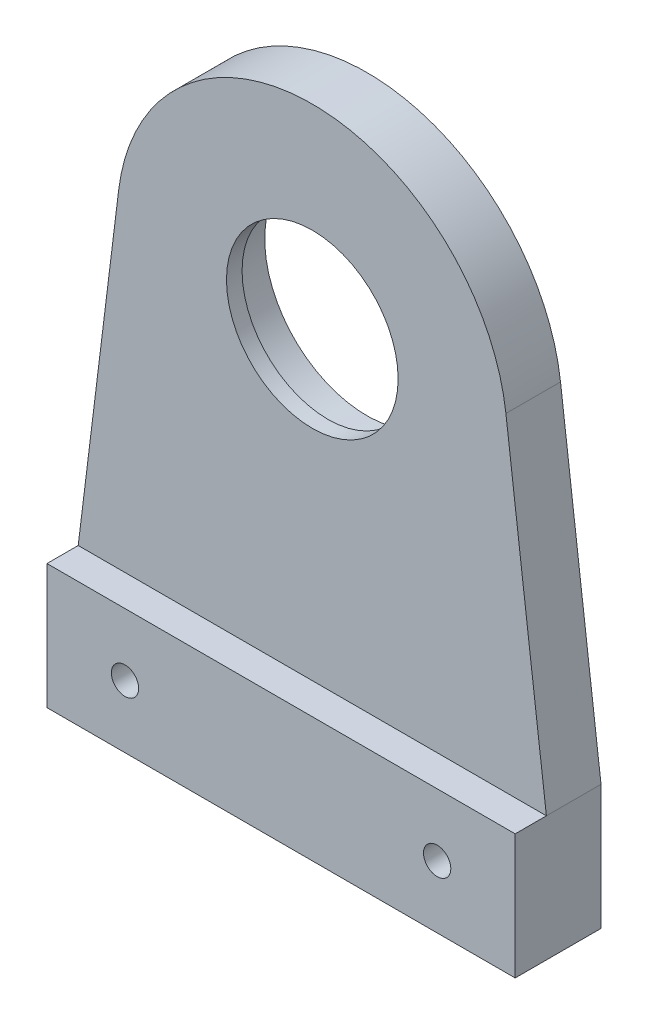
ISO-10303-21;
HEADER;
FILE_DESCRIPTION(('STEP AP214'),'2;1');
FILE_NAME('part.step','',(''),(''),'','','');
FILE_SCHEMA(('AUTOMOTIVE_DESIGN { 1 0 10303 214 1 1 1 1 }'));
ENDSEC;
DATA;
#1=APPLICATION_CONTEXT('core data for automotive mechanical design processes');
#2=APPLICATION_PROTOCOL_DEFINITION('international standard','automotive_design',2000,#1);
#3=PRODUCT_CONTEXT('',#1,'mechanical');
#4=PRODUCT('Part','Part','',(#3));
#5=PRODUCT_RELATED_PRODUCT_CATEGORY('part','',(#4));
#6=PRODUCT_DEFINITION_FORMATION('','',#4);
#7=PRODUCT_DEFINITION_CONTEXT('part definition',#1,'design');
#8=PRODUCT_DEFINITION('design','',#6,#7);
#9=PRODUCT_DEFINITION_SHAPE('','',#8);
#10=(LENGTH_UNIT() NAMED_UNIT(*) SI_UNIT(.MILLI.,.METRE.));
#11=(NAMED_UNIT(*) PLANE_ANGLE_UNIT() SI_UNIT($,.RADIAN.));
#12=(NAMED_UNIT(*) SI_UNIT($,.STERADIAN.) SOLID_ANGLE_UNIT());
#13=UNCERTAINTY_MEASURE_WITH_UNIT(LENGTH_MEASURE(1.E-05),#10,'distance_accuracy_value','');
#14=(GEOMETRIC_REPRESENTATION_CONTEXT(3) GLOBAL_UNCERTAINTY_ASSIGNED_CONTEXT((#13)) GLOBAL_UNIT_ASSIGNED_CONTEXT((#10,
#11,#12)) REPRESENTATION_CONTEXT('',''));
#15=CARTESIAN_POINT('',(0.,0.,0.));
#16=DIRECTION('',(0.,0.,1.));
#17=DIRECTION('',(1.,0.,0.));
#18=AXIS2_PLACEMENT_3D('',#15,#16,#17);
#19=CARTESIAN_POINT('',(-20.,-47.,7.));
#20=DIRECTION('',(0.,0.,-1.));
#21=DIRECTION('',(-1.,0.,0.));
#22=AXIS2_PLACEMENT_3D('',#19,#20,#21);
#23=CYLINDRICAL_SURFACE('',#22,1.75);
#24=CARTESIAN_POINT('',(-20.,-47.,11.));
#25=DIRECTION('',(0.,0.,1.));
#26=DIRECTION('',(1.,0.,0.));
#27=AXIS2_PLACEMENT_3D('',#24,#25,#26);
#28=CIRCLE('',#27,1.75);
#29=CARTESIAN_POINT('',(-18.25,-47.,11.));
#30=VERTEX_POINT('',#29);
#31=EDGE_CURVE('E218',#30,#30,#28,.T.);
#32=ORIENTED_EDGE('',*,*,#31,.T.);
#33=EDGE_LOOP('',(#32));
#34=FACE_BOUND('',#33,.T.);
#35=CARTESIAN_POINT('',(-20.,-47.,4.));
#36=DIRECTION('',(0.,0.,-1.));
#37=DIRECTION('',(-1.,0.,0.));
#38=AXIS2_PLACEMENT_3D('',#35,#36,#37);
#39=CIRCLE('',#38,1.75);
#40=CARTESIAN_POINT('',(-21.75,-47.,4.));
#41=VERTEX_POINT('',#40);
#42=EDGE_CURVE('E51',#41,#41,#39,.T.);
#43=ORIENTED_EDGE('',*,*,#42,.T.);
#44=EDGE_LOOP('',(#43));
#45=FACE_BOUND('',#44,.T.);
#46=ADVANCED_FACE('F47',(#34,#45),#23,.F.);
#47=CARTESIAN_POINT('',(20.,-47.,7.));
#48=DIRECTION('',(0.,0.,-1.));
#49=DIRECTION('',(-1.,0.,0.));
#50=AXIS2_PLACEMENT_3D('',#47,#48,#49);
#51=CYLINDRICAL_SURFACE('',#50,1.75);
#52=CARTESIAN_POINT('',(20.,-47.,11.));
#53=DIRECTION('',(0.,0.,1.));
#54=DIRECTION('',(1.,0.,0.));
#55=AXIS2_PLACEMENT_3D('',#52,#53,#54);
#56=CIRCLE('',#55,1.75);
#57=CARTESIAN_POINT('',(21.75,-47.,11.));
#58=VERTEX_POINT('',#57);
#59=EDGE_CURVE('E147',#58,#58,#56,.T.);
#60=ORIENTED_EDGE('',*,*,#59,.T.);
#61=EDGE_LOOP('',(#60));
#62=FACE_BOUND('',#61,.T.);
#63=CARTESIAN_POINT('',(20.,-47.,4.));
#64=DIRECTION('',(0.,0.,-1.));
#65=DIRECTION('',(-1.,0.,0.));
#66=AXIS2_PLACEMENT_3D('',#63,#64,#65);
#67=CIRCLE('',#66,1.75);
#68=CARTESIAN_POINT('',(18.25,-47.,4.));
#69=VERTEX_POINT('',#68);
#70=EDGE_CURVE('E210',#69,#69,#67,.T.);
#71=ORIENTED_EDGE('',*,*,#70,.T.);
#72=EDGE_LOOP('',(#71));
#73=FACE_BOUND('',#72,.T.);
#74=ADVANCED_FACE('F240',(#62,#73),#51,.F.);
#75=CARTESIAN_POINT('',(0.,0.,7.));
#76=DIRECTION('',(0.,0.,-1.));
#77=DIRECTION('',(-1.,0.,0.));
#78=AXIS2_PLACEMENT_3D('',#75,#76,#77);
#79=CYLINDRICAL_SURFACE('',#78,13.1);
#80=CARTESIAN_POINT('',(0.,0.,0.));
#81=DIRECTION('',(0.,0.,1.));
#82=DIRECTION('',(1.,0.,0.));
#83=AXIS2_PLACEMENT_3D('',#80,#81,#82);
#84=CIRCLE('',#83,13.1);
#85=CARTESIAN_POINT('',(13.1,0.,0.));
#86=VERTEX_POINT('',#85);
#87=EDGE_CURVE('E174',#86,#86,#84,.T.);
#88=ORIENTED_EDGE('',*,*,#87,.F.);
#89=EDGE_LOOP('',(#88));
#90=FACE_BOUND('',#89,.T.);
#91=CARTESIAN_POINT('',(0.,0.,5.));
#92=DIRECTION('',(0.,0.,1.));
#93=DIRECTION('',(1.,0.,0.));
#94=AXIS2_PLACEMENT_3D('',#91,#92,#93);
#95=CIRCLE('',#94,13.1);
#96=CARTESIAN_POINT('',(13.1,0.,5.));
#97=VERTEX_POINT('',#96);
#98=EDGE_CURVE('E167',#97,#97,#95,.T.);
#99=ORIENTED_EDGE('',*,*,#98,.T.);
#100=EDGE_LOOP('',(#99));
#101=FACE_BOUND('',#100,.T.);
#102=ADVANCED_FACE('F262',(#90,#101),#79,.F.);
#103=CARTESIAN_POINT('',(0.,0.,7.));
#104=DIRECTION('',(0.,0.,1.));
#105=DIRECTION('',(1.,0.,0.));
#106=AXIS2_PLACEMENT_3D('',#103,#104,#105);
#107=PLANE('',#106);
#108=DIRECTION('',(-1.,0.,0.));
#109=VECTOR('',#108,1.);
#110=CARTESIAN_POINT('',(-30.,-39.,7.));
#111=LINE('',#110,#109);
#112=CARTESIAN_POINT('',(30.,-39.,7.));
#113=VERTEX_POINT('',#112);
#114=CARTESIAN_POINT('',(-30.,-39.,7.));
#115=VERTEX_POINT('',#114);
#116=EDGE_CURVE('E105',#113,#115,#111,.T.);
#117=ORIENTED_EDGE('',*,*,#116,.F.);
#118=DIRECTION('',(-0.12241933334367,0.992478466680105,0.));
#119=VECTOR('',#118,1.);
#120=CARTESIAN_POINT('',(30.,-39.,7.));
#121=LINE('',#120,#119);
#122=CARTESIAN_POINT('',(24.8119616670026,3.06048333359175,7.));
#123=VERTEX_POINT('',#122);
#124=EDGE_CURVE('E178',#113,#123,#121,.T.);
#125=ORIENTED_EDGE('',*,*,#124,.T.);
#126=CARTESIAN_POINT('',(0.,0.,7.));
#127=DIRECTION('',(0.,0.,1.));
#128=DIRECTION('',(1.,0.,0.));
#129=AXIS2_PLACEMENT_3D('',#126,#127,#128);
#130=CIRCLE('',#129,25.);
#131=CARTESIAN_POINT('',(-24.8119616670026,3.06048333359175,7.));
#132=VERTEX_POINT('',#131);
#133=EDGE_CURVE('E66',#123,#132,#130,.T.);
#134=ORIENTED_EDGE('',*,*,#133,.T.);
#135=DIRECTION('',(-0.12241933334367,-0.992478466680105,0.));
#136=VECTOR('',#135,1.);
#137=CARTESIAN_POINT('',(-30.,-39.,7.));
#138=LINE('',#137,#136);
#139=EDGE_CURVE('E183',#132,#115,#138,.T.);
#140=ORIENTED_EDGE('',*,*,#139,.T.);
#141=EDGE_LOOP('',(#117,#125,#134,#140));
#142=FACE_BOUND('',#141,.T.);
#143=CARTESIAN_POINT('',(0.,0.,7.));
#144=DIRECTION('',(0.,0.,1.));
#145=DIRECTION('',(1.,0.,0.));
#146=AXIS2_PLACEMENT_3D('',#143,#144,#145);
#147=CIRCLE('',#146,11.);
#148=CARTESIAN_POINT('',(11.,0.,7.));
#149=VERTEX_POINT('',#148);
#150=EDGE_CURVE('E162',#149,#149,#147,.T.);
#151=ORIENTED_EDGE('',*,*,#150,.F.);
#152=EDGE_LOOP('',(#151));
#153=FACE_BOUND('',#152,.T.);
#154=ADVANCED_FACE('F269',(#142,#153),#107,.T.);
#155=CARTESIAN_POINT('',(0.,0.,0.));
#156=DIRECTION('',(0.,0.,1.));
#157=DIRECTION('',(1.,0.,0.));
#158=AXIS2_PLACEMENT_3D('',#155,#156,#157);
#159=PLANE('',#158);
#160=CARTESIAN_POINT('',(20.,-47.,0.));
#161=DIRECTION('',(0.,0.,-1.));
#162=DIRECTION('',(-1.,0.,0.));
#163=AXIS2_PLACEMENT_3D('',#160,#161,#162);
#164=CIRCLE('',#163,3.75);
#165=CARTESIAN_POINT('',(16.25,-47.,0.));
#166=VERTEX_POINT('',#165);
#167=EDGE_CURVE('E220',#166,#166,#164,.T.);
#168=ORIENTED_EDGE('',*,*,#167,.F.);
#169=EDGE_LOOP('',(#168));
#170=FACE_BOUND('',#169,.T.);
#171=CARTESIAN_POINT('',(-20.,-47.,0.));
#172=DIRECTION('',(0.,0.,-1.));
#173=DIRECTION('',(-1.,0.,0.));
#174=AXIS2_PLACEMENT_3D('',#171,#172,#173);
#175=CIRCLE('',#174,3.75);
#176=CARTESIAN_POINT('',(-23.75,-47.,0.));
#177=VERTEX_POINT('',#176);
#178=EDGE_CURVE('E226',#177,#177,#175,.T.);
#179=ORIENTED_EDGE('',*,*,#178,.F.);
#180=EDGE_LOOP('',(#179));
#181=FACE_BOUND('',#180,.T.);
#182=DIRECTION('',(0.,-1.,0.));
#183=VECTOR('',#182,1.);
#184=CARTESIAN_POINT('',(-30.,-55.,0.));
#185=LINE('',#184,#183);
#186=CARTESIAN_POINT('',(-30.,-39.,0.));
#187=VERTEX_POINT('',#186);
#188=CARTESIAN_POINT('',(-30.,-55.,0.));
#189=VERTEX_POINT('',#188);
#190=EDGE_CURVE('E129',#187,#189,#185,.T.);
#191=ORIENTED_EDGE('',*,*,#190,.F.);
#192=DIRECTION('',(-0.12241933334367,-0.992478466680105,0.));
#193=VECTOR('',#192,1.);
#194=CARTESIAN_POINT('',(-30.,-39.,0.));
#195=LINE('',#194,#193);
#196=CARTESIAN_POINT('',(-24.8119616670026,3.06048333359175,0.));
#197=VERTEX_POINT('',#196);
#198=EDGE_CURVE('E99',#197,#187,#195,.T.);
#199=ORIENTED_EDGE('',*,*,#198,.F.);
#200=CARTESIAN_POINT('',(0.,0.,0.));
#201=DIRECTION('',(0.,0.,1.));
#202=DIRECTION('',(1.,0.,0.));
#203=AXIS2_PLACEMENT_3D('',#200,#201,#202);
#204=CIRCLE('',#203,25.);
#205=CARTESIAN_POINT('',(24.8119616670026,3.06048333359175,0.));
#206=VERTEX_POINT('',#205);
#207=EDGE_CURVE('E93',#206,#197,#204,.T.);
#208=ORIENTED_EDGE('',*,*,#207,.F.);
#209=DIRECTION('',(-0.12241933334367,0.992478466680105,0.));
#210=VECTOR('',#209,1.);
#211=CARTESIAN_POINT('',(30.,-39.,0.));
#212=LINE('',#211,#210);
#213=CARTESIAN_POINT('',(30.,-39.,0.));
#214=VERTEX_POINT('',#213);
#215=EDGE_CURVE('E193',#214,#206,#212,.T.);
#216=ORIENTED_EDGE('',*,*,#215,.F.);
#217=DIRECTION('',(0.,1.,0.));
#218=VECTOR('',#217,1.);
#219=CARTESIAN_POINT('',(30.,-55.,0.));
#220=LINE('',#219,#218);
#221=CARTESIAN_POINT('',(30.,-55.,0.));
#222=VERTEX_POINT('',#221);
#223=EDGE_CURVE('E190',#222,#214,#220,.T.);
#224=ORIENTED_EDGE('',*,*,#223,.F.);
#225=DIRECTION('',(1.,0.,0.));
#226=VECTOR('',#225,1.);
#227=CARTESIAN_POINT('',(-30.,-55.,0.));
#228=LINE('',#227,#226);
#229=EDGE_CURVE('E187',#189,#222,#228,.T.);
#230=ORIENTED_EDGE('',*,*,#229,.F.);
#231=EDGE_LOOP('',(#191,#199,#208,#216,#224,#230));
#232=FACE_BOUND('',#231,.T.);
#233=ORIENTED_EDGE('',*,*,#87,.T.);
#234=EDGE_LOOP('',(#233));
#235=FACE_BOUND('',#234,.T.);
#236=ADVANCED_FACE('F273',(#170,#181,#232,#235),#159,.F.);
#237=CARTESIAN_POINT('',(-30.,-55.,7.));
#238=DIRECTION('',(1.,0.,0.));
#239=DIRECTION('',(0.,0.,-1.));
#240=AXIS2_PLACEMENT_3D('',#237,#238,#239);
#241=PLANE('',#240);
#242=ORIENTED_EDGE('',*,*,#190,.T.);
#243=DIRECTION('',(0.,0.,-1.));
#244=VECTOR('',#243,1.);
#245=CARTESIAN_POINT('',(-30.,-55.,7.));
#246=LINE('',#245,#244);
#247=CARTESIAN_POINT('',(-30.,-55.,11.));
#248=VERTEX_POINT('',#247);
#249=EDGE_CURVE('E11',#248,#189,#246,.T.);
#250=ORIENTED_EDGE('',*,*,#249,.F.);
#251=DIRECTION('',(0.,-1.,0.));
#252=VECTOR('',#251,1.);
#253=CARTESIAN_POINT('',(-30.,-55.,11.));
#254=LINE('',#253,#252);
#255=CARTESIAN_POINT('',(-30.,-39.,11.));
#256=VERTEX_POINT('',#255);
#257=EDGE_CURVE('E127',#256,#248,#254,.T.);
#258=ORIENTED_EDGE('',*,*,#257,.F.);
#259=DIRECTION('',(0.,0.,-1.));
#260=VECTOR('',#259,1.);
#261=CARTESIAN_POINT('',(-30.,-39.,11.));
#262=LINE('',#261,#260);
#263=EDGE_CURVE('E155',#256,#115,#262,.T.);
#264=ORIENTED_EDGE('',*,*,#263,.T.);
#265=DIRECTION('',(0.,0.,-1.));
#266=VECTOR('',#265,1.);
#267=CARTESIAN_POINT('',(-30.,-39.,7.));
#268=LINE('',#267,#266);
#269=EDGE_CURVE('E185',#115,#187,#268,.T.);
#270=ORIENTED_EDGE('',*,*,#269,.T.);
#271=EDGE_LOOP('',(#242,#250,#258,#264,#270));
#272=FACE_BOUND('',#271,.T.);
#273=ADVANCED_FACE('F49',(#272),#241,.F.);
#274=CARTESIAN_POINT('',(-30.,-55.,7.));
#275=DIRECTION('',(0.,1.,0.));
#276=DIRECTION('',(0.,0.,1.));
#277=AXIS2_PLACEMENT_3D('',#274,#275,#276);
#278=PLANE('',#277);
#279=ORIENTED_EDGE('',*,*,#229,.T.);
#280=DIRECTION('',(0.,0.,-1.));
#281=VECTOR('',#280,1.);
#282=CARTESIAN_POINT('',(30.,-55.,7.));
#283=LINE('',#282,#281);
#284=CARTESIAN_POINT('',(30.,-55.,11.));
#285=VERTEX_POINT('',#284);
#286=EDGE_CURVE('E57',#285,#222,#283,.T.);
#287=ORIENTED_EDGE('',*,*,#286,.F.);
#288=DIRECTION('',(1.,0.,0.));
#289=VECTOR('',#288,1.);
#290=CARTESIAN_POINT('',(-30.,-55.,11.));
#291=LINE('',#290,#289);
#292=EDGE_CURVE('E132',#248,#285,#291,.T.);
#293=ORIENTED_EDGE('',*,*,#292,.F.);
#294=ORIENTED_EDGE('',*,*,#249,.T.);
#295=EDGE_LOOP('',(#279,#287,#293,#294));
#296=FACE_BOUND('',#295,.T.);
#297=ADVANCED_FACE('F133',(#296),#278,.F.);
#298=CARTESIAN_POINT('',(30.,-55.,7.));
#299=DIRECTION('',(-1.,0.,0.));
#300=DIRECTION('',(0.,0.,1.));
#301=AXIS2_PLACEMENT_3D('',#298,#299,#300);
#302=PLANE('',#301);
#303=ORIENTED_EDGE('',*,*,#223,.T.);
#304=DIRECTION('',(0.,0.,-1.));
#305=VECTOR('',#304,1.);
#306=CARTESIAN_POINT('',(30.,-39.,7.));
#307=LINE('',#306,#305);
#308=EDGE_CURVE('E205',#113,#214,#307,.T.);
#309=ORIENTED_EDGE('',*,*,#308,.F.);
#310=DIRECTION('',(0.,0.,-1.));
#311=VECTOR('',#310,1.);
#312=CARTESIAN_POINT('',(30.,-39.,11.));
#313=LINE('',#312,#311);
#314=CARTESIAN_POINT('',(30.,-39.,11.));
#315=VERTEX_POINT('',#314);
#316=EDGE_CURVE('E158',#315,#113,#313,.T.);
#317=ORIENTED_EDGE('',*,*,#316,.F.);
#318=DIRECTION('',(0.,1.,0.));
#319=VECTOR('',#318,1.);
#320=CARTESIAN_POINT('',(30.,-55.,11.));
#321=LINE('',#320,#319);
#322=EDGE_CURVE('E138',#285,#315,#321,.T.);
#323=ORIENTED_EDGE('',*,*,#322,.F.);
#324=ORIENTED_EDGE('',*,*,#286,.T.);
#325=EDGE_LOOP('',(#303,#309,#317,#323,#324));
#326=FACE_BOUND('',#325,.T.);
#327=ADVANCED_FACE('F286',(#326),#302,.F.);
#328=CARTESIAN_POINT('',(30.,-39.,7.));
#329=DIRECTION('',(-0.992478466680105,-0.12241933334367,0.));
#330=DIRECTION('',(0.12241933334367,-0.992478466680105,0.));
#331=AXIS2_PLACEMENT_3D('',#328,#329,#330);
#332=PLANE('',#331);
#333=ORIENTED_EDGE('',*,*,#215,.T.);
#334=DIRECTION('',(0.,0.,-1.));
#335=VECTOR('',#334,1.);
#336=CARTESIAN_POINT('',(24.8119616670026,3.06048333359175,7.));
#337=LINE('',#336,#335);
#338=EDGE_CURVE('E202',#123,#206,#337,.T.);
#339=ORIENTED_EDGE('',*,*,#338,.F.);
#340=ORIENTED_EDGE('',*,*,#124,.F.);
#341=ORIENTED_EDGE('',*,*,#308,.T.);
#342=EDGE_LOOP('',(#333,#339,#340,#341));
#343=FACE_BOUND('',#342,.T.);
#344=ADVANCED_FACE('F283',(#343),#332,.F.);
#345=CARTESIAN_POINT('',(0.,0.,7.));
#346=DIRECTION('',(0.,0.,-1.));
#347=DIRECTION('',(-1.,0.,0.));
#348=AXIS2_PLACEMENT_3D('',#345,#346,#347);
#349=CYLINDRICAL_SURFACE('',#348,25.);
#350=ORIENTED_EDGE('',*,*,#207,.T.);
#351=DIRECTION('',(0.,0.,-1.));
#352=VECTOR('',#351,1.);
#353=CARTESIAN_POINT('',(-24.8119616670026,3.06048333359175,7.));
#354=LINE('',#353,#352);
#355=EDGE_CURVE('E200',#132,#197,#354,.T.);
#356=ORIENTED_EDGE('',*,*,#355,.F.);
#357=ORIENTED_EDGE('',*,*,#133,.F.);
#358=ORIENTED_EDGE('',*,*,#338,.T.);
#359=EDGE_LOOP('',(#350,#356,#357,#358));
#360=FACE_BOUND('',#359,.T.);
#361=ADVANCED_FACE('F280',(#360),#349,.T.);
#362=CARTESIAN_POINT('',(-30.,-39.,7.));
#363=DIRECTION('',(0.992478466680105,-0.12241933334367,0.));
#364=DIRECTION('',(0.12241933334367,0.992478466680105,0.));
#365=AXIS2_PLACEMENT_3D('',#362,#363,#364);
#366=PLANE('',#365);
#367=ORIENTED_EDGE('',*,*,#198,.T.);
#368=ORIENTED_EDGE('',*,*,#269,.F.);
#369=ORIENTED_EDGE('',*,*,#139,.F.);
#370=ORIENTED_EDGE('',*,*,#355,.T.);
#371=EDGE_LOOP('',(#367,#368,#369,#370));
#372=FACE_BOUND('',#371,.T.);
#373=ADVANCED_FACE('F277',(#372),#366,.F.);
#374=CARTESIAN_POINT('',(0.,0.,5.));
#375=DIRECTION('',(0.,0.,1.));
#376=DIRECTION('',(1.,0.,0.));
#377=AXIS2_PLACEMENT_3D('',#374,#375,#376);
#378=PLANE('',#377);
#379=CARTESIAN_POINT('',(0.,0.,5.));
#380=DIRECTION('',(0.,0.,1.));
#381=DIRECTION('',(1.,0.,0.));
#382=AXIS2_PLACEMENT_3D('',#379,#380,#381);
#383=CIRCLE('',#382,11.);
#384=CARTESIAN_POINT('',(11.,0.,5.));
#385=VERTEX_POINT('',#384);
#386=EDGE_CURVE('E163',#385,#385,#383,.T.);
#387=ORIENTED_EDGE('',*,*,#386,.T.);
#388=EDGE_LOOP('',(#387));
#389=FACE_BOUND('',#388,.T.);
#390=ORIENTED_EDGE('',*,*,#98,.F.);
#391=EDGE_LOOP('',(#390));
#392=FACE_BOUND('',#391,.T.);
#393=ADVANCED_FACE('F252',(#389,#392),#378,.F.);
#394=CARTESIAN_POINT('',(0.,0.,5.));
#395=DIRECTION('',(0.,0.,1.));
#396=DIRECTION('',(1.,0.,0.));
#397=AXIS2_PLACEMENT_3D('',#394,#395,#396);
#398=CYLINDRICAL_SURFACE('',#397,11.);
#399=ORIENTED_EDGE('',*,*,#386,.F.);
#400=EDGE_LOOP('',(#399));
#401=FACE_BOUND('',#400,.T.);
#402=ORIENTED_EDGE('',*,*,#150,.T.);
#403=EDGE_LOOP('',(#402));
#404=FACE_BOUND('',#403,.T.);
#405=ADVANCED_FACE('F244',(#401,#404),#398,.F.);
#406=CARTESIAN_POINT('',(0.,0.,11.));
#407=DIRECTION('',(0.,0.,-1.));
#408=DIRECTION('',(-1.,0.,0.));
#409=AXIS2_PLACEMENT_3D('',#406,#407,#408);
#410=PLANE('',#409);
#411=ORIENTED_EDGE('',*,*,#257,.T.);
#412=ORIENTED_EDGE('',*,*,#292,.T.);
#413=ORIENTED_EDGE('',*,*,#322,.T.);
#414=DIRECTION('',(-1.,0.,0.));
#415=VECTOR('',#414,1.);
#416=CARTESIAN_POINT('',(-30.,-39.,11.));
#417=LINE('',#416,#415);
#418=EDGE_CURVE('E143',#315,#256,#417,.T.);
#419=ORIENTED_EDGE('',*,*,#418,.T.);
#420=EDGE_LOOP('',(#411,#412,#413,#419));
#421=FACE_BOUND('',#420,.T.);
#422=ORIENTED_EDGE('',*,*,#59,.F.);
#423=EDGE_LOOP('',(#422));
#424=FACE_BOUND('',#423,.T.);
#425=ORIENTED_EDGE('',*,*,#31,.F.);
#426=EDGE_LOOP('',(#425));
#427=FACE_BOUND('',#426,.T.);
#428=ADVANCED_FACE('F140',(#421,#424,#427),#410,.F.);
#429=CARTESIAN_POINT('',(-30.,-39.,11.));
#430=DIRECTION('',(0.,-1.,0.));
#431=DIRECTION('',(0.,0.,-1.));
#432=AXIS2_PLACEMENT_3D('',#429,#430,#431);
#433=PLANE('',#432);
#434=ORIENTED_EDGE('',*,*,#116,.T.);
#435=ORIENTED_EDGE('',*,*,#263,.F.);
#436=ORIENTED_EDGE('',*,*,#418,.F.);
#437=ORIENTED_EDGE('',*,*,#316,.T.);
#438=EDGE_LOOP('',(#434,#435,#436,#437));
#439=FACE_BOUND('',#438,.T.);
#440=ADVANCED_FACE('F243',(#439),#433,.F.);
#441=CARTESIAN_POINT('',(20.,-47.,4.));
#442=DIRECTION('',(0.,0.,-1.));
#443=DIRECTION('',(-1.,0.,0.));
#444=AXIS2_PLACEMENT_3D('',#441,#442,#443);
#445=CYLINDRICAL_SURFACE('',#444,3.75);
#446=CARTESIAN_POINT('',(20.,-47.,4.));
#447=DIRECTION('',(0.,0.,-1.));
#448=DIRECTION('',(-1.,0.,0.));
#449=AXIS2_PLACEMENT_3D('',#446,#447,#448);
#450=CIRCLE('',#449,3.75);
#451=CARTESIAN_POINT('',(16.25,-47.,4.));
#452=VERTEX_POINT('',#451);
#453=EDGE_CURVE('E213',#452,#452,#450,.T.);
#454=ORIENTED_EDGE('',*,*,#453,.F.);
#455=EDGE_LOOP('',(#454));
#456=FACE_BOUND('',#455,.T.);
#457=ORIENTED_EDGE('',*,*,#167,.T.);
#458=EDGE_LOOP('',(#457));
#459=FACE_BOUND('',#458,.T.);
#460=ADVANCED_FACE('F248',(#456,#459),#445,.F.);
#461=CARTESIAN_POINT('',(20.,-47.,4.));
#462=DIRECTION('',(0.,0.,-1.));
#463=DIRECTION('',(-1.,0.,0.));
#464=AXIS2_PLACEMENT_3D('',#461,#462,#463);
#465=PLANE('',#464);
#466=ORIENTED_EDGE('',*,*,#70,.F.);
#467=EDGE_LOOP('',(#466));
#468=FACE_BOUND('',#467,.T.);
#469=ORIENTED_EDGE('',*,*,#453,.T.);
#470=EDGE_LOOP('',(#469));
#471=FACE_BOUND('',#470,.T.);
#472=ADVANCED_FACE('F375',(#468,#471),#465,.T.);
#473=CARTESIAN_POINT('',(-20.,-47.,4.));
#474=DIRECTION('',(0.,0.,-1.));
#475=DIRECTION('',(-1.,0.,0.));
#476=AXIS2_PLACEMENT_3D('',#473,#474,#475);
#477=CYLINDRICAL_SURFACE('',#476,3.75);
#478=CARTESIAN_POINT('',(-20.,-47.,4.));
#479=DIRECTION('',(0.,0.,-1.));
#480=DIRECTION('',(-1.,0.,0.));
#481=AXIS2_PLACEMENT_3D('',#478,#479,#480);
#482=CIRCLE('',#481,3.75);
#483=CARTESIAN_POINT('',(-23.75,-47.,4.));
#484=VERTEX_POINT('',#483);
#485=EDGE_CURVE('E231',#484,#484,#482,.T.);
#486=ORIENTED_EDGE('',*,*,#485,.F.);
#487=EDGE_LOOP('',(#486));
#488=FACE_BOUND('',#487,.T.);
#489=ORIENTED_EDGE('',*,*,#178,.T.);
#490=EDGE_LOOP('',(#489));
#491=FACE_BOUND('',#490,.T.);
#492=ADVANCED_FACE('F385',(#488,#491),#477,.F.);
#493=CARTESIAN_POINT('',(-20.,-47.,4.));
#494=DIRECTION('',(0.,0.,-1.));
#495=DIRECTION('',(-1.,0.,0.));
#496=AXIS2_PLACEMENT_3D('',#493,#494,#495);
#497=PLANE('',#496);
#498=ORIENTED_EDGE('',*,*,#42,.F.);
#499=EDGE_LOOP('',(#498));
#500=FACE_BOUND('',#499,.T.);
#501=ORIENTED_EDGE('',*,*,#485,.T.);
#502=EDGE_LOOP('',(#501));
#503=FACE_BOUND('',#502,.T.);
#504=ADVANCED_FACE('F394',(#500,#503),#497,.T.);
#505=CLOSED_SHELL('',(#46,#74,#102,#154,#236,#273,#297,#327,#344,#361,#373,#393,#405,#428,#440,
#460,#472,#492,#504));
#506=MANIFOLD_SOLID_BREP('B2',#505);
#507=ADVANCED_BREP_SHAPE_REPRESENTATION('',(#18,#506),#14);
#508=SHAPE_DEFINITION_REPRESENTATION(#9,#507);
ENDSEC;
END-ISO-10303-21;
